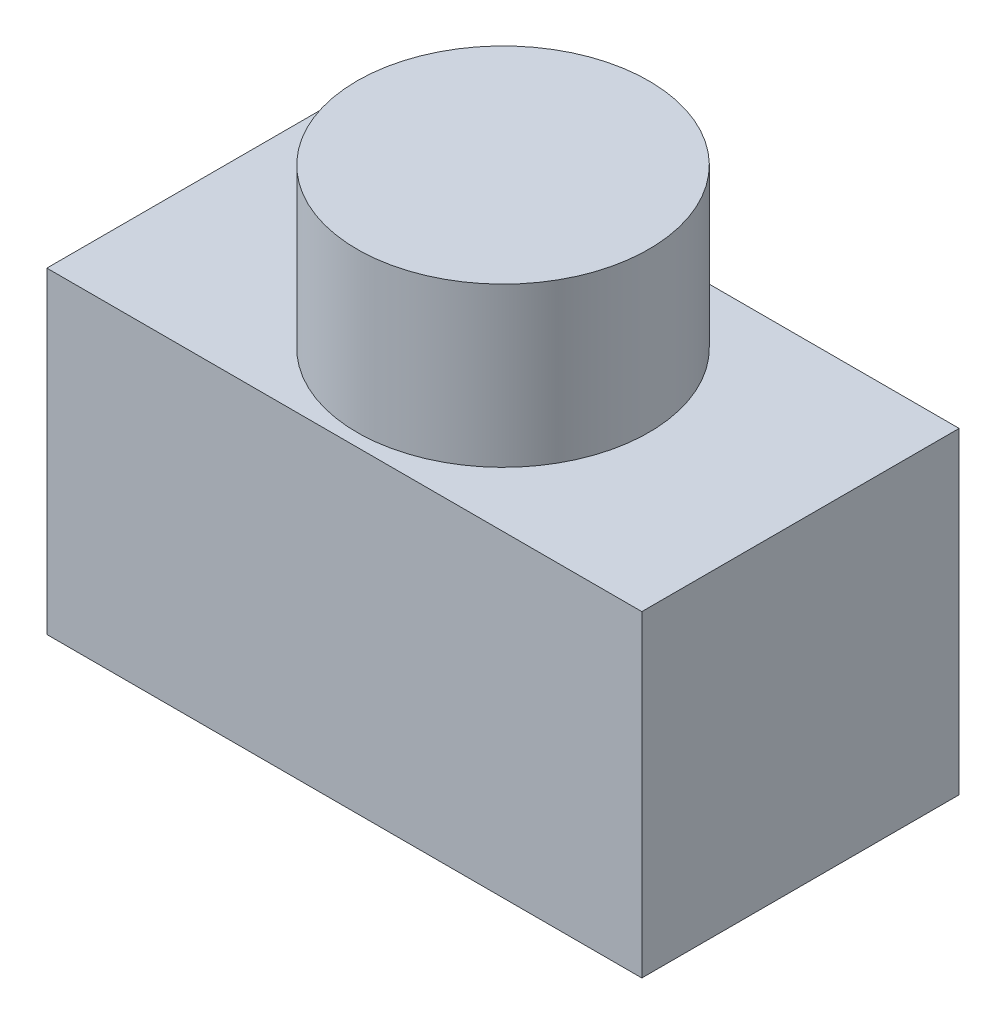
ISO-10303-21;
HEADER;
FILE_DESCRIPTION(('STEP AP214'),'2;1');
FILE_NAME('part.step','',(''),(''),'','','');
FILE_SCHEMA(('AUTOMOTIVE_DESIGN { 1 0 10303 214 1 1 1 1 }'));
ENDSEC;
DATA;
#1=APPLICATION_CONTEXT('core data for automotive mechanical design processes');
#2=APPLICATION_PROTOCOL_DEFINITION('international standard','automotive_design',2000,#1);
#3=PRODUCT_CONTEXT('',#1,'mechanical');
#4=PRODUCT('Part','Part','',(#3));
#5=PRODUCT_RELATED_PRODUCT_CATEGORY('part','',(#4));
#6=PRODUCT_DEFINITION_FORMATION('','',#4);
#7=PRODUCT_DEFINITION_CONTEXT('part definition',#1,'design');
#8=PRODUCT_DEFINITION('design','',#6,#7);
#9=PRODUCT_DEFINITION_SHAPE('','',#8);
#10=(LENGTH_UNIT() NAMED_UNIT(*) SI_UNIT(.MILLI.,.METRE.));
#11=(NAMED_UNIT(*) PLANE_ANGLE_UNIT() SI_UNIT($,.RADIAN.));
#12=(NAMED_UNIT(*) SI_UNIT($,.STERADIAN.) SOLID_ANGLE_UNIT());
#13=UNCERTAINTY_MEASURE_WITH_UNIT(LENGTH_MEASURE(1.E-05),#10,'distance_accuracy_value','');
#14=(GEOMETRIC_REPRESENTATION_CONTEXT(3) GLOBAL_UNCERTAINTY_ASSIGNED_CONTEXT((#13)) GLOBAL_UNIT_ASSIGNED_CONTEXT((#10,
#11,#12)) REPRESENTATION_CONTEXT('',''));
#15=CARTESIAN_POINT('',(0.,0.,0.));
#16=DIRECTION('',(0.,0.,1.));
#17=DIRECTION('',(1.,0.,0.));
#18=AXIS2_PLACEMENT_3D('',#15,#16,#17);
#19=CARTESIAN_POINT('',(37.5,-40.0000000000001,19.9999999999995));
#20=DIRECTION('',(-1.,0.,0.));
#21=DIRECTION('',(0.,-1.,0.));
#22=AXIS2_PLACEMENT_3D('',#19,#20,#21);
#23=PLANE('',#22);
#24=DIRECTION('',(0.,0.,1.));
#25=VECTOR('',#24,1.);
#26=CARTESIAN_POINT('',(37.5,-1.37043154602168E-13,20.0000000000002));
#27=LINE('',#26,#25);
#28=CARTESIAN_POINT('',(37.5,5.58580959264532E-13,-19.9999999999998));
#29=VERTEX_POINT('',#28);
#30=CARTESIAN_POINT('',(37.5,-1.37043154602168E-13,20.0000000000002));
#31=VERTEX_POINT('',#30);
#32=EDGE_CURVE('E101',#29,#31,#27,.T.);
#33=ORIENTED_EDGE('',*,*,#32,.T.);
#34=DIRECTION('',(0.,1.,0.));
#35=VECTOR('',#34,1.);
#36=CARTESIAN_POINT('',(37.5,-40.0000000000001,19.9999999999995));
#37=LINE('',#36,#35);
#38=CARTESIAN_POINT('',(37.5,-40.0000000000001,19.9999999999995));
#39=VERTEX_POINT('',#38);
#40=EDGE_CURVE('E38',#39,#31,#37,.T.);
#41=ORIENTED_EDGE('',*,*,#40,.F.);
#42=DIRECTION('',(0.,0.,1.));
#43=VECTOR('',#42,1.);
#44=CARTESIAN_POINT('',(37.5,-40.0000000000001,19.9999999999995));
#45=LINE('',#44,#43);
#46=CARTESIAN_POINT('',(37.5,-39.9999999999994,-20.0000000000005));
#47=VERTEX_POINT('',#46);
#48=EDGE_CURVE('E88',#47,#39,#45,.T.);
#49=ORIENTED_EDGE('',*,*,#48,.F.);
#50=DIRECTION('',(0.,1.,0.));
#51=VECTOR('',#50,1.);
#52=CARTESIAN_POINT('',(37.5,-39.9999999999994,-20.0000000000005));
#53=LINE('',#52,#51);
#54=EDGE_CURVE('E97',#47,#29,#53,.T.);
#55=ORIENTED_EDGE('',*,*,#54,.T.);
#56=EDGE_LOOP('',(#33,#41,#49,#55));
#57=FACE_BOUND('',#56,.T.);
#58=ADVANCED_FACE('F35',(#57),#23,.F.);
#59=CARTESIAN_POINT('',(-37.5,-40.0000000000001,19.9999999999995));
#60=DIRECTION('',(0.,0.,-1.));
#61=DIRECTION('',(0.,1.,0.));
#62=AXIS2_PLACEMENT_3D('',#59,#60,#61);
#63=PLANE('',#62);
#64=DIRECTION('',(-1.,0.,0.));
#65=VECTOR('',#64,1.);
#66=CARTESIAN_POINT('',(-37.5,-1.37043154602168E-13,20.0000000000002));
#67=LINE('',#66,#65);
#68=CARTESIAN_POINT('',(-37.5,-1.37043154602168E-13,20.0000000000002));
#69=VERTEX_POINT('',#68);
#70=EDGE_CURVE('E93',#31,#69,#67,.T.);
#71=ORIENTED_EDGE('',*,*,#70,.T.);
#72=DIRECTION('',(0.,1.,0.));
#73=VECTOR('',#72,1.);
#74=CARTESIAN_POINT('',(-37.5,-40.0000000000001,19.9999999999995));
#75=LINE('',#74,#73);
#76=CARTESIAN_POINT('',(-37.5,-40.0000000000001,19.9999999999995));
#77=VERTEX_POINT('',#76);
#78=EDGE_CURVE('E91',#77,#69,#75,.T.);
#79=ORIENTED_EDGE('',*,*,#78,.F.);
#80=DIRECTION('',(-1.,0.,0.));
#81=VECTOR('',#80,1.);
#82=CARTESIAN_POINT('',(-37.5,-40.0000000000001,19.9999999999995));
#83=LINE('',#82,#81);
#84=EDGE_CURVE('E83',#39,#77,#83,.T.);
#85=ORIENTED_EDGE('',*,*,#84,.F.);
#86=ORIENTED_EDGE('',*,*,#40,.T.);
#87=EDGE_LOOP('',(#71,#79,#85,#86));
#88=FACE_BOUND('',#87,.T.);
#89=ADVANCED_FACE('F92',(#88),#63,.F.);
#90=CARTESIAN_POINT('',(-37.5,-40.0000000000001,19.9999999999995));
#91=DIRECTION('',(1.,0.,0.));
#92=DIRECTION('',(0.,1.,0.));
#93=AXIS2_PLACEMENT_3D('',#90,#91,#92);
#94=PLANE('',#93);
#95=DIRECTION('',(0.,0.,-1.));
#96=VECTOR('',#95,1.);
#97=CARTESIAN_POINT('',(-37.5,-1.37043154602168E-13,20.0000000000002));
#98=LINE('',#97,#96);
#99=CARTESIAN_POINT('',(-37.5,5.58580959264532E-13,-19.9999999999998));
#100=VERTEX_POINT('',#99);
#101=EDGE_CURVE('E69',#69,#100,#98,.T.);
#102=ORIENTED_EDGE('',*,*,#101,.T.);
#103=DIRECTION('',(0.,1.,0.));
#104=VECTOR('',#103,1.);
#105=CARTESIAN_POINT('',(-37.5,-39.9999999999994,-20.0000000000005));
#106=LINE('',#105,#104);
#107=CARTESIAN_POINT('',(-37.5,-39.9999999999994,-20.0000000000005));
#108=VERTEX_POINT('',#107);
#109=EDGE_CURVE('E94',#108,#100,#106,.T.);
#110=ORIENTED_EDGE('',*,*,#109,.F.);
#111=DIRECTION('',(0.,0.,-1.));
#112=VECTOR('',#111,1.);
#113=CARTESIAN_POINT('',(-37.5,-40.0000000000001,19.9999999999995));
#114=LINE('',#113,#112);
#115=EDGE_CURVE('E86',#77,#108,#114,.T.);
#116=ORIENTED_EDGE('',*,*,#115,.F.);
#117=ORIENTED_EDGE('',*,*,#78,.T.);
#118=EDGE_LOOP('',(#102,#110,#116,#117));
#119=FACE_BOUND('',#118,.T.);
#120=ADVANCED_FACE('F95',(#119),#94,.F.);
#121=CARTESIAN_POINT('',(-37.5,-39.9999999999994,-20.0000000000005));
#122=DIRECTION('',(0.,0.,1.));
#123=DIRECTION('',(0.,-1.,0.));
#124=AXIS2_PLACEMENT_3D('',#121,#122,#123);
#125=PLANE('',#124);
#126=DIRECTION('',(1.,0.,0.));
#127=VECTOR('',#126,1.);
#128=CARTESIAN_POINT('',(-37.5,5.58580959264532E-13,-19.9999999999998));
#129=LINE('',#128,#127);
#130=EDGE_CURVE('E75',#100,#29,#129,.T.);
#131=ORIENTED_EDGE('',*,*,#130,.T.);
#132=ORIENTED_EDGE('',*,*,#54,.F.);
#133=DIRECTION('',(1.,0.,0.));
#134=VECTOR('',#133,1.);
#135=CARTESIAN_POINT('',(-37.5,-39.9999999999994,-20.0000000000005));
#136=LINE('',#135,#134);
#137=EDGE_CURVE('E52',#108,#47,#136,.T.);
#138=ORIENTED_EDGE('',*,*,#137,.F.);
#139=ORIENTED_EDGE('',*,*,#109,.T.);
#140=EDGE_LOOP('',(#131,#132,#138,#139));
#141=FACE_BOUND('',#140,.T.);
#142=ADVANCED_FACE('F109',(#141),#125,.F.);
#143=CARTESIAN_POINT('',(0.,-39.9999999999998,-4.52762827229947E-13));
#144=DIRECTION('',(0.,-1.,0.));
#145=DIRECTION('',(1.,0.,0.));
#146=AXIS2_PLACEMENT_3D('',#143,#144,#145);
#147=PLANE('',#146);
#148=ORIENTED_EDGE('',*,*,#48,.T.);
#149=ORIENTED_EDGE('',*,*,#84,.T.);
#150=ORIENTED_EDGE('',*,*,#115,.T.);
#151=ORIENTED_EDGE('',*,*,#137,.T.);
#152=EDGE_LOOP('',(#148,#149,#150,#151));
#153=FACE_BOUND('',#152,.T.);
#154=ADVANCED_FACE('F84',(#153),#147,.T.);
#155=CARTESIAN_POINT('',(0.,2.09901540593194E-13,2.4459601011273E-13));
#156=DIRECTION('',(0.,-1.,0.));
#157=DIRECTION('',(1.,0.,0.));
#158=AXIS2_PLACEMENT_3D('',#155,#156,#157);
#159=PLANE('',#158);
#160=CARTESIAN_POINT('',(0.,2.09901540593194E-13,2.4459601011273E-13));
#161=DIRECTION('',(0.,1.,0.));
#162=DIRECTION('',(-1.,0.,0.));
#163=AXIS2_PLACEMENT_3D('',#160,#161,#162);
#164=CIRCLE('',#163,18.39);
#165=CARTESIAN_POINT('',(-18.39,2.09901540593194E-13,2.4459601011273E-13));
#166=VERTEX_POINT('',#165);
#167=EDGE_CURVE('E11',#166,#166,#164,.T.);
#168=ORIENTED_EDGE('',*,*,#167,.F.);
#169=EDGE_LOOP('',(#168));
#170=FACE_BOUND('',#169,.T.);
#171=ORIENTED_EDGE('',*,*,#32,.F.);
#172=ORIENTED_EDGE('',*,*,#130,.F.);
#173=ORIENTED_EDGE('',*,*,#101,.F.);
#174=ORIENTED_EDGE('',*,*,#70,.F.);
#175=EDGE_LOOP('',(#171,#172,#173,#174));
#176=FACE_BOUND('',#175,.T.);
#177=ADVANCED_FACE('F112',(#170,#176),#159,.F.);
#178=CARTESIAN_POINT('',(0.,20.0000000000002,5.95010152260045E-13));
#179=DIRECTION('',(0.,-1.,0.));
#180=DIRECTION('',(1.,0.,0.));
#181=AXIS2_PLACEMENT_3D('',#178,#179,#180);
#182=CYLINDRICAL_SURFACE('',#181,18.39);
#183=CARTESIAN_POINT('',(0.,20.0000000000002,5.95010152260045E-13));
#184=DIRECTION('',(0.,1.,0.));
#185=DIRECTION('',(-1.,0.,0.));
#186=AXIS2_PLACEMENT_3D('',#183,#184,#185);
#187=CIRCLE('',#186,18.39);
#188=CARTESIAN_POINT('',(-18.39,20.0000000000002,5.95010152260045E-13));
#189=VERTEX_POINT('',#188);
#190=EDGE_CURVE('E104',#189,#189,#187,.T.);
#191=ORIENTED_EDGE('',*,*,#190,.F.);
#192=EDGE_LOOP('',(#191));
#193=FACE_BOUND('',#192,.T.);
#194=ORIENTED_EDGE('',*,*,#167,.T.);
#195=EDGE_LOOP('',(#194));
#196=FACE_BOUND('',#195,.T.);
#197=ADVANCED_FACE('F120',(#193,#196),#182,.T.);
#198=CARTESIAN_POINT('',(0.,20.0000000000002,5.95010152260045E-13));
#199=DIRECTION('',(0.,1.,0.));
#200=DIRECTION('',(-1.,0.,0.));
#201=AXIS2_PLACEMENT_3D('',#198,#199,#200);
#202=PLANE('',#201);
#203=ORIENTED_EDGE('',*,*,#190,.T.);
#204=EDGE_LOOP('',(#203));
#205=FACE_BOUND('',#204,.T.);
#206=ADVANCED_FACE('F118',(#205),#202,.T.);
#207=CLOSED_SHELL('',(#58,#89,#120,#142,#154,#177,#197,#206));
#208=MANIFOLD_SOLID_BREP('B2',#207);
#209=ADVANCED_BREP_SHAPE_REPRESENTATION('',(#18,#208),#14);
#210=SHAPE_DEFINITION_REPRESENTATION(#9,#209);
ENDSEC;
END-ISO-10303-21;
